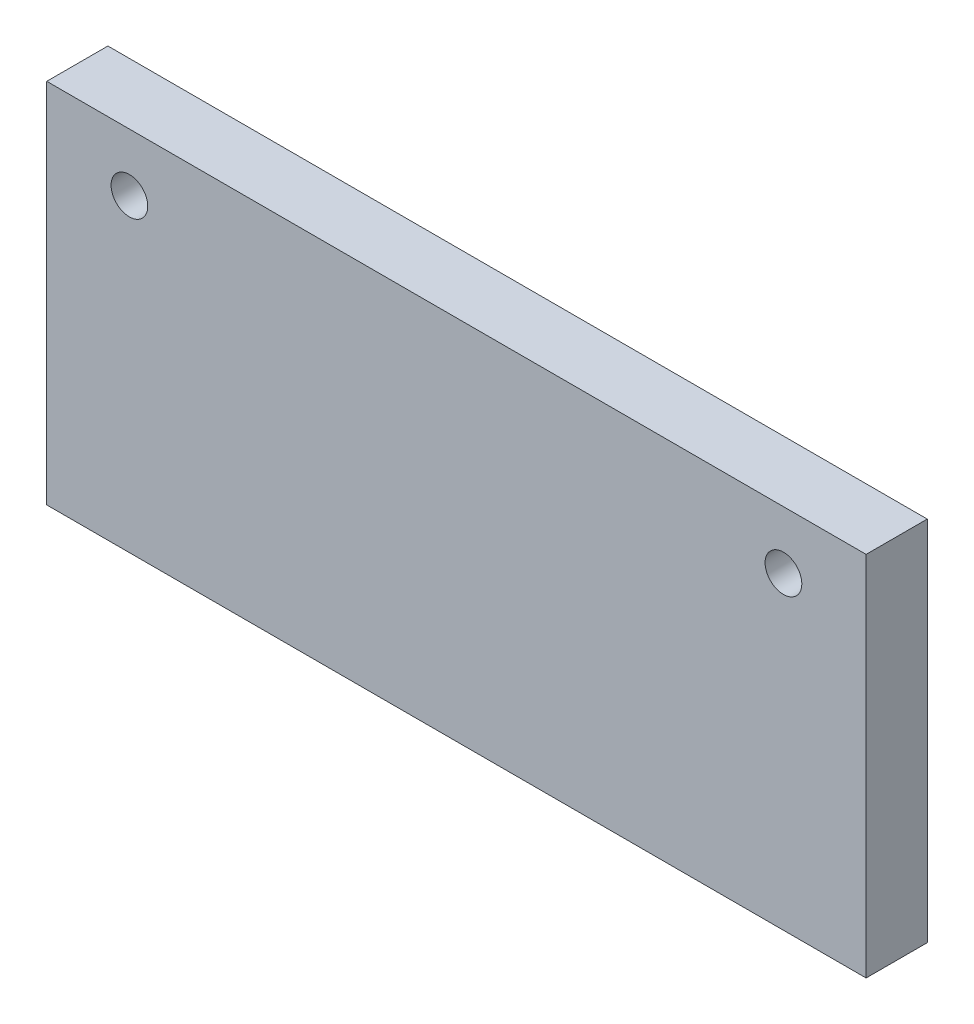
ISO-10303-21;
HEADER;
FILE_DESCRIPTION(('STEP AP214'),'2;1');
FILE_NAME('part.step','',(''),(''),'','','');
FILE_SCHEMA(('AUTOMOTIVE_DESIGN { 1 0 10303 214 1 1 1 1 }'));
ENDSEC;
DATA;
#1=APPLICATION_CONTEXT('core data for automotive mechanical design processes');
#2=APPLICATION_PROTOCOL_DEFINITION('international standard','automotive_design',2000,#1);
#3=PRODUCT_CONTEXT('',#1,'mechanical');
#4=PRODUCT('Part','Part','',(#3));
#5=PRODUCT_RELATED_PRODUCT_CATEGORY('part','',(#4));
#6=PRODUCT_DEFINITION_FORMATION('','',#4);
#7=PRODUCT_DEFINITION_CONTEXT('part definition',#1,'design');
#8=PRODUCT_DEFINITION('design','',#6,#7);
#9=PRODUCT_DEFINITION_SHAPE('','',#8);
#10=(LENGTH_UNIT() NAMED_UNIT(*) SI_UNIT(.MILLI.,.METRE.));
#11=(NAMED_UNIT(*) PLANE_ANGLE_UNIT() SI_UNIT($,.RADIAN.));
#12=(NAMED_UNIT(*) SI_UNIT($,.STERADIAN.) SOLID_ANGLE_UNIT());
#13=UNCERTAINTY_MEASURE_WITH_UNIT(LENGTH_MEASURE(1.E-05),#10,'distance_accuracy_value','');
#14=(GEOMETRIC_REPRESENTATION_CONTEXT(3) GLOBAL_UNCERTAINTY_ASSIGNED_CONTEXT((#13)) GLOBAL_UNIT_ASSIGNED_CONTEXT((#10,
#11,#12)) REPRESENTATION_CONTEXT('',''));
#15=CARTESIAN_POINT('',(0.,0.,0.));
#16=DIRECTION('',(0.,0.,1.));
#17=DIRECTION('',(1.,0.,0.));
#18=AXIS2_PLACEMENT_3D('',#15,#16,#17);
#19=CARTESIAN_POINT('',(0.,0.,10.));
#20=DIRECTION('',(0.,0.,-1.));
#21=DIRECTION('',(-1.,0.,0.));
#22=AXIS2_PLACEMENT_3D('',#19,#20,#21);
#23=PLANE('',#22);
#24=DIRECTION('',(0.,-1.,0.));
#25=VECTOR('',#24,1.);
#26=CARTESIAN_POINT('',(0.,0.,10.));
#27=LINE('',#26,#25);
#28=CARTESIAN_POINT('',(0.,60.,10.));
#29=VERTEX_POINT('',#28);
#30=CARTESIAN_POINT('',(0.,0.,10.));
#31=VERTEX_POINT('',#30);
#32=EDGE_CURVE('E89',#29,#31,#27,.T.);
#33=ORIENTED_EDGE('',*,*,#32,.T.);
#34=DIRECTION('',(1.,0.,0.));
#35=VECTOR('',#34,1.);
#36=CARTESIAN_POINT('',(0.,0.,10.));
#37=LINE('',#36,#35);
#38=CARTESIAN_POINT('',(134.,0.,10.));
#39=VERTEX_POINT('',#38);
#40=EDGE_CURVE('E84',#31,#39,#37,.T.);
#41=ORIENTED_EDGE('',*,*,#40,.T.);
#42=DIRECTION('',(0.,1.,0.));
#43=VECTOR('',#42,1.);
#44=CARTESIAN_POINT('',(134.,0.,10.));
#45=LINE('',#44,#43);
#46=CARTESIAN_POINT('',(134.,60.,10.));
#47=VERTEX_POINT('',#46);
#48=EDGE_CURVE('E87',#39,#47,#45,.T.);
#49=ORIENTED_EDGE('',*,*,#48,.T.);
#50=DIRECTION('',(-1.,0.,0.));
#51=VECTOR('',#50,1.);
#52=CARTESIAN_POINT('',(0.,60.,10.));
#53=LINE('',#52,#51);
#54=EDGE_CURVE('E54',#47,#29,#53,.T.);
#55=ORIENTED_EDGE('',*,*,#54,.T.);
#56=EDGE_LOOP('',(#33,#41,#49,#55));
#57=FACE_BOUND('',#56,.T.);
#58=CARTESIAN_POINT('',(13.5186765956572,50.5566107377366,10.));
#59=DIRECTION('',(0.,0.,1.));
#60=DIRECTION('',(1.,0.,0.));
#61=AXIS2_PLACEMENT_3D('',#58,#59,#60);
#62=CIRCLE('',#61,3.);
#63=CARTESIAN_POINT('',(16.5186765956572,50.5566107377366,10.));
#64=VERTEX_POINT('',#63);
#65=EDGE_CURVE('E104',#64,#64,#62,.T.);
#66=ORIENTED_EDGE('',*,*,#65,.F.);
#67=EDGE_LOOP('',(#66));
#68=FACE_BOUND('',#67,.T.);
#69=CARTESIAN_POINT('',(120.481323404343,50.5566107377366,10.));
#70=DIRECTION('',(0.,0.,1.));
#71=DIRECTION('',(-1.,0.,0.));
#72=AXIS2_PLACEMENT_3D('',#69,#70,#71);
#73=CIRCLE('',#72,3.00000000000001);
#74=CARTESIAN_POINT('',(117.481323404343,50.5566107377366,10.));
#75=VERTEX_POINT('',#74);
#76=EDGE_CURVE('E119',#75,#75,#73,.T.);
#77=ORIENTED_EDGE('',*,*,#76,.F.);
#78=EDGE_LOOP('',(#77));
#79=FACE_BOUND('',#78,.T.);
#80=ADVANCED_FACE('F37',(#57,#68,#79),#23,.F.);
#81=CARTESIAN_POINT('',(0.,0.,0.));
#82=DIRECTION('',(0.,0.,-1.));
#83=DIRECTION('',(-1.,0.,0.));
#84=AXIS2_PLACEMENT_3D('',#81,#82,#83);
#85=PLANE('',#84);
#86=CARTESIAN_POINT('',(13.5186765956572,50.5566107377366,0.));
#87=DIRECTION('',(0.,0.,1.));
#88=DIRECTION('',(1.,0.,0.));
#89=AXIS2_PLACEMENT_3D('',#86,#87,#88);
#90=CIRCLE('',#89,3.);
#91=CARTESIAN_POINT('',(16.5186765956572,50.5566107377366,0.));
#92=VERTEX_POINT('',#91);
#93=EDGE_CURVE('E116',#92,#92,#90,.T.);
#94=ORIENTED_EDGE('',*,*,#93,.T.);
#95=EDGE_LOOP('',(#94));
#96=FACE_BOUND('',#95,.T.);
#97=DIRECTION('',(0.,-1.,0.));
#98=VECTOR('',#97,1.);
#99=CARTESIAN_POINT('',(0.,0.,0.));
#100=LINE('',#99,#98);
#101=CARTESIAN_POINT('',(0.,60.,0.));
#102=VERTEX_POINT('',#101);
#103=CARTESIAN_POINT('',(0.,0.,0.));
#104=VERTEX_POINT('',#103);
#105=EDGE_CURVE('E101',#102,#104,#100,.T.);
#106=ORIENTED_EDGE('',*,*,#105,.F.);
#107=DIRECTION('',(-1.,0.,0.));
#108=VECTOR('',#107,1.);
#109=CARTESIAN_POINT('',(0.,60.,0.));
#110=LINE('',#109,#108);
#111=CARTESIAN_POINT('',(134.,60.,0.));
#112=VERTEX_POINT('',#111);
#113=EDGE_CURVE('E77',#112,#102,#110,.T.);
#114=ORIENTED_EDGE('',*,*,#113,.F.);
#115=DIRECTION('',(0.,1.,0.));
#116=VECTOR('',#115,1.);
#117=CARTESIAN_POINT('',(134.,0.,0.));
#118=LINE('',#117,#116);
#119=CARTESIAN_POINT('',(134.,0.,0.));
#120=VERTEX_POINT('',#119);
#121=EDGE_CURVE('E71',#120,#112,#118,.T.);
#122=ORIENTED_EDGE('',*,*,#121,.F.);
#123=DIRECTION('',(1.,0.,0.));
#124=VECTOR('',#123,1.);
#125=CARTESIAN_POINT('',(0.,0.,0.));
#126=LINE('',#125,#124);
#127=EDGE_CURVE('E93',#104,#120,#126,.T.);
#128=ORIENTED_EDGE('',*,*,#127,.F.);
#129=EDGE_LOOP('',(#106,#114,#122,#128));
#130=FACE_BOUND('',#129,.T.);
#131=CARTESIAN_POINT('',(120.481323404343,50.5566107377366,0.));
#132=DIRECTION('',(0.,0.,1.));
#133=DIRECTION('',(-1.,0.,0.));
#134=AXIS2_PLACEMENT_3D('',#131,#132,#133);
#135=CIRCLE('',#134,3.00000000000001);
#136=CARTESIAN_POINT('',(117.481323404343,50.5566107377366,0.));
#137=VERTEX_POINT('',#136);
#138=EDGE_CURVE('E122',#137,#137,#135,.T.);
#139=ORIENTED_EDGE('',*,*,#138,.T.);
#140=EDGE_LOOP('',(#139));
#141=FACE_BOUND('',#140,.T.);
#142=ADVANCED_FACE('F112',(#96,#130,#141),#85,.T.);
#143=CARTESIAN_POINT('',(0.,0.,10.));
#144=DIRECTION('',(1.,0.,0.));
#145=DIRECTION('',(0.,0.,-1.));
#146=AXIS2_PLACEMENT_3D('',#143,#144,#145);
#147=PLANE('',#146);
#148=ORIENTED_EDGE('',*,*,#105,.T.);
#149=DIRECTION('',(0.,0.,-1.));
#150=VECTOR('',#149,1.);
#151=CARTESIAN_POINT('',(0.,0.,10.));
#152=LINE('',#151,#150);
#153=EDGE_CURVE('E11',#31,#104,#152,.T.);
#154=ORIENTED_EDGE('',*,*,#153,.F.);
#155=ORIENTED_EDGE('',*,*,#32,.F.);
#156=DIRECTION('',(0.,0.,-1.));
#157=VECTOR('',#156,1.);
#158=CARTESIAN_POINT('',(0.,60.,10.));
#159=LINE('',#158,#157);
#160=EDGE_CURVE('E97',#29,#102,#159,.T.);
#161=ORIENTED_EDGE('',*,*,#160,.T.);
#162=EDGE_LOOP('',(#148,#154,#155,#161));
#163=FACE_BOUND('',#162,.T.);
#164=ADVANCED_FACE('F39',(#163),#147,.F.);
#165=CARTESIAN_POINT('',(0.,0.,10.));
#166=DIRECTION('',(0.,1.,0.));
#167=DIRECTION('',(0.,0.,1.));
#168=AXIS2_PLACEMENT_3D('',#165,#166,#167);
#169=PLANE('',#168);
#170=ORIENTED_EDGE('',*,*,#127,.T.);
#171=DIRECTION('',(0.,0.,-1.));
#172=VECTOR('',#171,1.);
#173=CARTESIAN_POINT('',(134.,0.,10.));
#174=LINE('',#173,#172);
#175=EDGE_CURVE('E46',#39,#120,#174,.T.);
#176=ORIENTED_EDGE('',*,*,#175,.F.);
#177=ORIENTED_EDGE('',*,*,#40,.F.);
#178=ORIENTED_EDGE('',*,*,#153,.T.);
#179=EDGE_LOOP('',(#170,#176,#177,#178));
#180=FACE_BOUND('',#179,.T.);
#181=ADVANCED_FACE('F92',(#180),#169,.F.);
#182=CARTESIAN_POINT('',(134.,0.,10.));
#183=DIRECTION('',(-1.,0.,0.));
#184=DIRECTION('',(0.,0.,1.));
#185=AXIS2_PLACEMENT_3D('',#182,#183,#184);
#186=PLANE('',#185);
#187=ORIENTED_EDGE('',*,*,#121,.T.);
#188=DIRECTION('',(0.,0.,-1.));
#189=VECTOR('',#188,1.);
#190=CARTESIAN_POINT('',(134.,60.,10.));
#191=LINE('',#190,#189);
#192=EDGE_CURVE('E94',#47,#112,#191,.T.);
#193=ORIENTED_EDGE('',*,*,#192,.F.);
#194=ORIENTED_EDGE('',*,*,#48,.F.);
#195=ORIENTED_EDGE('',*,*,#175,.T.);
#196=EDGE_LOOP('',(#187,#193,#194,#195));
#197=FACE_BOUND('',#196,.T.);
#198=ADVANCED_FACE('F95',(#197),#186,.F.);
#199=CARTESIAN_POINT('',(0.,60.,10.));
#200=DIRECTION('',(0.,-1.,0.));
#201=DIRECTION('',(0.,0.,-1.));
#202=AXIS2_PLACEMENT_3D('',#199,#200,#201);
#203=PLANE('',#202);
#204=ORIENTED_EDGE('',*,*,#113,.T.);
#205=ORIENTED_EDGE('',*,*,#160,.F.);
#206=ORIENTED_EDGE('',*,*,#54,.F.);
#207=ORIENTED_EDGE('',*,*,#192,.T.);
#208=EDGE_LOOP('',(#204,#205,#206,#207));
#209=FACE_BOUND('',#208,.T.);
#210=ADVANCED_FACE('F109',(#209),#203,.F.);
#211=CARTESIAN_POINT('',(13.5186765956572,50.5566107377366,10.));
#212=DIRECTION('',(0.,0.,-1.));
#213=DIRECTION('',(-1.,0.,0.));
#214=AXIS2_PLACEMENT_3D('',#211,#212,#213);
#215=CYLINDRICAL_SURFACE('',#214,3.);
#216=ORIENTED_EDGE('',*,*,#65,.T.);
#217=EDGE_LOOP('',(#216));
#218=FACE_BOUND('',#217,.T.);
#219=ORIENTED_EDGE('',*,*,#93,.F.);
#220=EDGE_LOOP('',(#219));
#221=FACE_BOUND('',#220,.T.);
#222=ADVANCED_FACE('F139',(#218,#221),#215,.F.);
#223=CARTESIAN_POINT('',(120.481323404343,50.5566107377366,10.));
#224=DIRECTION('',(0.,0.,-1.));
#225=DIRECTION('',(-1.,0.,0.));
#226=AXIS2_PLACEMENT_3D('',#223,#224,#225);
#227=CYLINDRICAL_SURFACE('',#226,3.00000000000001);
#228=ORIENTED_EDGE('',*,*,#76,.T.);
#229=EDGE_LOOP('',(#228));
#230=FACE_BOUND('',#229,.T.);
#231=ORIENTED_EDGE('',*,*,#138,.F.);
#232=EDGE_LOOP('',(#231));
#233=FACE_BOUND('',#232,.T.);
#234=ADVANCED_FACE('F128',(#230,#233),#227,.F.);
#235=CLOSED_SHELL('',(#80,#142,#164,#181,#198,#210,#222,#234));
#236=MANIFOLD_SOLID_BREP('B2',#235);
#237=ADVANCED_BREP_SHAPE_REPRESENTATION('',(#18,#236),#14);
#238=SHAPE_DEFINITION_REPRESENTATION(#9,#237);
ENDSEC;
END-ISO-10303-21;
